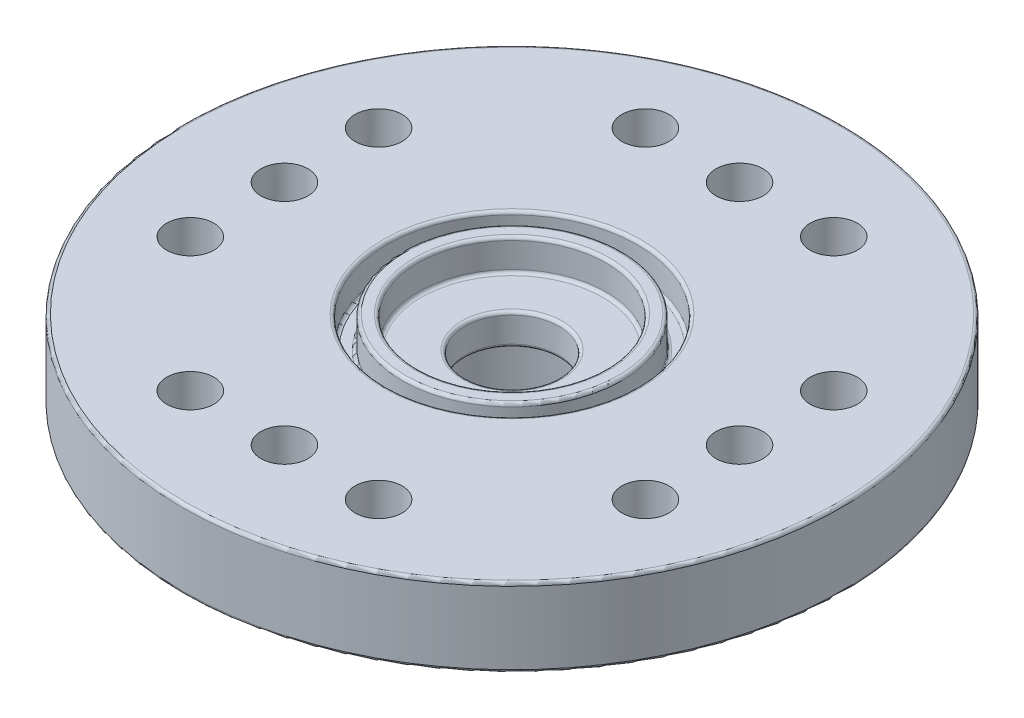
ISO-10303-21;
HEADER;
FILE_DESCRIPTION(('STEP AP214'),'2;1');
FILE_NAME('part.step','',(''),(''),'','','');
FILE_SCHEMA(('AUTOMOTIVE_DESIGN { 1 0 10303 214 1 1 1 1 }'));
ENDSEC;
DATA;
#1=APPLICATION_CONTEXT('core data for automotive mechanical design processes');
#2=APPLICATION_PROTOCOL_DEFINITION('international standard','automotive_design',2000,#1);
#3=PRODUCT_CONTEXT('',#1,'mechanical');
#4=PRODUCT('Part','Part','',(#3));
#5=PRODUCT_RELATED_PRODUCT_CATEGORY('part','',(#4));
#6=PRODUCT_DEFINITION_FORMATION('','',#4);
#7=PRODUCT_DEFINITION_CONTEXT('part definition',#1,'design');
#8=PRODUCT_DEFINITION('design','',#6,#7);
#9=PRODUCT_DEFINITION_SHAPE('','',#8);
#10=(LENGTH_UNIT() NAMED_UNIT(*) SI_UNIT(.MILLI.,.METRE.));
#11=(NAMED_UNIT(*) PLANE_ANGLE_UNIT() SI_UNIT($,.RADIAN.));
#12=(NAMED_UNIT(*) SI_UNIT($,.STERADIAN.) SOLID_ANGLE_UNIT());
#13=UNCERTAINTY_MEASURE_WITH_UNIT(LENGTH_MEASURE(1.E-05),#10,'distance_accuracy_value','');
#14=(GEOMETRIC_REPRESENTATION_CONTEXT(3) GLOBAL_UNCERTAINTY_ASSIGNED_CONTEXT((#13)) GLOBAL_UNIT_ASSIGNED_CONTEXT((#10,
#11,#12)) REPRESENTATION_CONTEXT('',''));
#15=CARTESIAN_POINT('',(0.,0.,0.));
#16=DIRECTION('',(0.,0.,1.));
#17=DIRECTION('',(1.,0.,0.));
#18=AXIS2_PLACEMENT_3D('',#15,#16,#17);
#19=CARTESIAN_POINT('',(0.,2.5,0.));
#20=DIRECTION('',(0.,1.,0.));
#21=DIRECTION('',(0.,0.,1.));
#22=AXIS2_PLACEMENT_3D('',#19,#20,#21);
#23=PLANE('',#22);
#24=CARTESIAN_POINT('',(0.,2.5,0.));
#25=DIRECTION('',(0.,1.,0.));
#26=DIRECTION('',(0.,0.,1.));
#27=AXIS2_PLACEMENT_3D('',#24,#25,#26);
#28=CIRCLE('',#27,3.1);
#29=CARTESIAN_POINT('',(0.,2.5,3.1));
#30=VERTEX_POINT('',#29);
#31=EDGE_CURVE('E57',#30,#30,#28,.F.);
#32=ORIENTED_EDGE('',*,*,#31,.T.);
#33=EDGE_LOOP('',(#32));
#34=FACE_BOUND('',#33,.T.);
#35=CARTESIAN_POINT('',(0.,2.5,0.));
#36=DIRECTION('',(0.,1.,0.));
#37=DIRECTION('',(0.,0.,1.));
#38=AXIS2_PLACEMENT_3D('',#35,#36,#37);
#39=CIRCLE('',#38,3.4);
#40=CARTESIAN_POINT('',(0.,2.5,3.4));
#41=VERTEX_POINT('',#40);
#42=EDGE_CURVE('E60',#41,#41,#39,.T.);
#43=ORIENTED_EDGE('',*,*,#42,.T.);
#44=EDGE_LOOP('',(#43));
#45=FACE_BOUND('',#44,.T.);
#46=ADVANCED_FACE('F34',(#34,#45),#23,.T.);
#47=CARTESIAN_POINT('',(0.,-9.5,0.));
#48=DIRECTION('',(0.,1.,0.));
#49=DIRECTION('',(0.,0.,1.));
#50=AXIS2_PLACEMENT_3D('',#47,#48,#49);
#51=CYLINDRICAL_SURFACE('',#50,3.);
#52=CARTESIAN_POINT('',(0.,-2.9,0.));
#53=DIRECTION('',(0.,-1.,0.));
#54=DIRECTION('',(0.,0.,-1.));
#55=AXIS2_PLACEMENT_3D('',#52,#53,#54);
#56=CIRCLE('',#55,3.);
#57=CARTESIAN_POINT('',(0.,-2.9,-3.));
#58=VERTEX_POINT('',#57);
#59=EDGE_CURVE('E111',#58,#58,#56,.T.);
#60=ORIENTED_EDGE('',*,*,#59,.T.);
#61=EDGE_LOOP('',(#60));
#62=FACE_BOUND('',#61,.T.);
#63=CARTESIAN_POINT('',(0.,0.5,0.));
#64=DIRECTION('',(0.,1.,0.));
#65=DIRECTION('',(0.,0.,1.));
#66=AXIS2_PLACEMENT_3D('',#63,#64,#65);
#67=CIRCLE('',#66,3.);
#68=CARTESIAN_POINT('',(0.,0.5,3.));
#69=VERTEX_POINT('',#68);
#70=EDGE_CURVE('E114',#69,#69,#67,.F.);
#71=ORIENTED_EDGE('',*,*,#70,.F.);
#72=EDGE_LOOP('',(#71));
#73=FACE_BOUND('',#72,.T.);
#74=ADVANCED_FACE('F215',(#62,#73),#51,.F.);
#75=CARTESIAN_POINT('',(0.,0.,0.));
#76=DIRECTION('',(0.,1.,0.));
#77=DIRECTION('',(0.,0.,1.));
#78=AXIS2_PLACEMENT_3D('',#75,#76,#77);
#79=PLANE('',#78);
#80=CARTESIAN_POINT('',(0.,0.,0.));
#81=DIRECTION('',(0.,1.,0.));
#82=DIRECTION('',(0.,0.,1.));
#83=AXIS2_PLACEMENT_3D('',#80,#81,#82);
#84=CIRCLE('',#83,10.4);
#85=CARTESIAN_POINT('',(0.,0.,10.4));
#86=VERTEX_POINT('',#85);
#87=EDGE_CURVE('E10',#86,#86,#84,.F.);
#88=ORIENTED_EDGE('',*,*,#87,.T.);
#89=EDGE_LOOP('',(#88));
#90=FACE_BOUND('',#89,.T.);
#91=CARTESIAN_POINT('',(-7.25,0.,-3.));
#92=DIRECTION('',(0.,1.,0.));
#93=DIRECTION('',(0.,0.,1.));
#94=AXIS2_PLACEMENT_3D('',#91,#92,#93);
#95=CIRCLE('',#94,0.749999999999999);
#96=CARTESIAN_POINT('',(-7.25,0.,-2.25));
#97=VERTEX_POINT('',#96);
#98=EDGE_CURVE('E120',#97,#97,#95,.T.);
#99=ORIENTED_EDGE('',*,*,#98,.T.);
#100=EDGE_LOOP('',(#99));
#101=FACE_BOUND('',#100,.T.);
#102=CARTESIAN_POINT('',(-7.25,0.,0.));
#103=DIRECTION('',(0.,1.,0.));
#104=DIRECTION('',(0.,0.,1.));
#105=AXIS2_PLACEMENT_3D('',#102,#103,#104);
#106=CIRCLE('',#105,0.749999999999999);
#107=CARTESIAN_POINT('',(-7.25,0.,0.749999999999999));
#108=VERTEX_POINT('',#107);
#109=EDGE_CURVE('E123',#108,#108,#106,.T.);
#110=ORIENTED_EDGE('',*,*,#109,.T.);
#111=EDGE_LOOP('',(#110));
#112=FACE_BOUND('',#111,.T.);
#113=CARTESIAN_POINT('',(-7.25,0.,3.));
#114=DIRECTION('',(0.,1.,0.));
#115=DIRECTION('',(0.,0.,1.));
#116=AXIS2_PLACEMENT_3D('',#113,#114,#115);
#117=CIRCLE('',#116,0.749999999999999);
#118=CARTESIAN_POINT('',(-7.25,0.,3.75));
#119=VERTEX_POINT('',#118);
#120=EDGE_CURVE('E126',#119,#119,#117,.T.);
#121=ORIENTED_EDGE('',*,*,#120,.T.);
#122=EDGE_LOOP('',(#121));
#123=FACE_BOUND('',#122,.T.);
#124=CARTESIAN_POINT('',(-3.,0.,7.25));
#125=DIRECTION('',(0.,1.,0.));
#126=DIRECTION('',(0.,0.,1.));
#127=AXIS2_PLACEMENT_3D('',#124,#125,#126);
#128=CIRCLE('',#127,0.75);
#129=CARTESIAN_POINT('',(-3.,0.,8.));
#130=VERTEX_POINT('',#129);
#131=EDGE_CURVE('E129',#130,#130,#128,.T.);
#132=ORIENTED_EDGE('',*,*,#131,.T.);
#133=EDGE_LOOP('',(#132));
#134=FACE_BOUND('',#133,.T.);
#135=CARTESIAN_POINT('',(0.,0.,7.25));
#136=DIRECTION('',(0.,1.,0.));
#137=DIRECTION('',(0.,0.,1.));
#138=AXIS2_PLACEMENT_3D('',#135,#136,#137);
#139=CIRCLE('',#138,0.75);
#140=CARTESIAN_POINT('',(0.,0.,8.));
#141=VERTEX_POINT('',#140);
#142=EDGE_CURVE('E132',#141,#141,#139,.T.);
#143=ORIENTED_EDGE('',*,*,#142,.T.);
#144=EDGE_LOOP('',(#143));
#145=FACE_BOUND('',#144,.T.);
#146=CARTESIAN_POINT('',(3.,0.,7.25));
#147=DIRECTION('',(0.,1.,0.));
#148=DIRECTION('',(0.,0.,1.));
#149=AXIS2_PLACEMENT_3D('',#146,#147,#148);
#150=CIRCLE('',#149,0.75);
#151=CARTESIAN_POINT('',(3.,0.,8.));
#152=VERTEX_POINT('',#151);
#153=EDGE_CURVE('E135',#152,#152,#150,.T.);
#154=ORIENTED_EDGE('',*,*,#153,.T.);
#155=EDGE_LOOP('',(#154));
#156=FACE_BOUND('',#155,.T.);
#157=CARTESIAN_POINT('',(7.25,0.,3.));
#158=DIRECTION('',(0.,1.,0.));
#159=DIRECTION('',(0.,0.,1.));
#160=AXIS2_PLACEMENT_3D('',#157,#158,#159);
#161=CIRCLE('',#160,0.749999999999999);
#162=CARTESIAN_POINT('',(7.25,0.,3.75));
#163=VERTEX_POINT('',#162);
#164=EDGE_CURVE('E138',#163,#163,#161,.T.);
#165=ORIENTED_EDGE('',*,*,#164,.T.);
#166=EDGE_LOOP('',(#165));
#167=FACE_BOUND('',#166,.T.);
#168=CARTESIAN_POINT('',(-3.,0.,-7.25));
#169=DIRECTION('',(0.,1.,0.));
#170=DIRECTION('',(0.,0.,1.));
#171=AXIS2_PLACEMENT_3D('',#168,#169,#170);
#172=CIRCLE('',#171,0.75);
#173=CARTESIAN_POINT('',(-3.,0.,-6.5));
#174=VERTEX_POINT('',#173);
#175=EDGE_CURVE('E141',#174,#174,#172,.T.);
#176=ORIENTED_EDGE('',*,*,#175,.T.);
#177=EDGE_LOOP('',(#176));
#178=FACE_BOUND('',#177,.T.);
#179=CARTESIAN_POINT('',(3.,0.,-7.25));
#180=DIRECTION('',(0.,1.,0.));
#181=DIRECTION('',(0.,0.,1.));
#182=AXIS2_PLACEMENT_3D('',#179,#180,#181);
#183=CIRCLE('',#182,0.75);
#184=CARTESIAN_POINT('',(3.,0.,-6.5));
#185=VERTEX_POINT('',#184);
#186=EDGE_CURVE('E144',#185,#185,#183,.T.);
#187=ORIENTED_EDGE('',*,*,#186,.T.);
#188=EDGE_LOOP('',(#187));
#189=FACE_BOUND('',#188,.T.);
#190=CARTESIAN_POINT('',(7.25,0.,-3.));
#191=DIRECTION('',(0.,1.,0.));
#192=DIRECTION('',(0.,0.,1.));
#193=AXIS2_PLACEMENT_3D('',#190,#191,#192);
#194=CIRCLE('',#193,0.749999999999999);
#195=CARTESIAN_POINT('',(7.25,0.,-2.25));
#196=VERTEX_POINT('',#195);
#197=EDGE_CURVE('E147',#196,#196,#194,.T.);
#198=ORIENTED_EDGE('',*,*,#197,.T.);
#199=EDGE_LOOP('',(#198));
#200=FACE_BOUND('',#199,.T.);
#201=CARTESIAN_POINT('',(7.25,0.,0.));
#202=DIRECTION('',(0.,1.,0.));
#203=DIRECTION('',(0.,0.,1.));
#204=AXIS2_PLACEMENT_3D('',#201,#202,#203);
#205=CIRCLE('',#204,0.749999999999999);
#206=CARTESIAN_POINT('',(7.25,0.,0.749999999999999));
#207=VERTEX_POINT('',#206);
#208=EDGE_CURVE('E150',#207,#207,#205,.T.);
#209=ORIENTED_EDGE('',*,*,#208,.T.);
#210=EDGE_LOOP('',(#209));
#211=FACE_BOUND('',#210,.T.);
#212=CARTESIAN_POINT('',(0.,0.,-7.25));
#213=DIRECTION('',(0.,1.,0.));
#214=DIRECTION('',(0.,0.,1.));
#215=AXIS2_PLACEMENT_3D('',#212,#213,#214);
#216=CIRCLE('',#215,0.75);
#217=CARTESIAN_POINT('',(0.,0.,-6.5));
#218=VERTEX_POINT('',#217);
#219=EDGE_CURVE('E153',#218,#218,#216,.T.);
#220=ORIENTED_EDGE('',*,*,#219,.T.);
#221=EDGE_LOOP('',(#220));
#222=FACE_BOUND('',#221,.T.);
#223=CARTESIAN_POINT('',(0.,0.,0.));
#224=DIRECTION('',(0.,1.,0.));
#225=DIRECTION('',(0.,0.,1.));
#226=AXIS2_PLACEMENT_3D('',#223,#224,#225);
#227=CIRCLE('',#226,4.);
#228=CARTESIAN_POINT('',(0.,0.,4.));
#229=VERTEX_POINT('',#228);
#230=EDGE_CURVE('E117',#229,#229,#227,.F.);
#231=ORIENTED_EDGE('',*,*,#230,.F.);
#232=EDGE_LOOP('',(#231));
#233=FACE_BOUND('',#232,.T.);
#234=ADVANCED_FACE('F212',(#90,#101,#112,#123,#134,#145,#156,#167,#178,#189,#200,#211,#222,
#233),#79,.F.);
#235=CARTESIAN_POINT('',(0.,2.5,0.));
#236=DIRECTION('',(0.,-1.,0.));
#237=DIRECTION('',(0.,0.,-1.));
#238=AXIS2_PLACEMENT_3D('',#235,#236,#237);
#239=CYLINDRICAL_SURFACE('',#238,10.5);
#240=CARTESIAN_POINT('',(0.,0.0999999999999998,0.));
#241=DIRECTION('',(0.,1.,0.));
#242=DIRECTION('',(0.,0.,1.));
#243=AXIS2_PLACEMENT_3D('',#240,#241,#242);
#244=CIRCLE('',#243,10.5);
#245=CARTESIAN_POINT('',(0.,0.0999999999999998,10.5));
#246=VERTEX_POINT('',#245);
#247=EDGE_CURVE('E41',#246,#246,#244,.T.);
#248=ORIENTED_EDGE('',*,*,#247,.T.);
#249=EDGE_LOOP('',(#248));
#250=FACE_BOUND('',#249,.T.);
#251=CARTESIAN_POINT('',(0.,2.4,0.));
#252=DIRECTION('',(0.,1.,0.));
#253=DIRECTION('',(0.,0.,1.));
#254=AXIS2_PLACEMENT_3D('',#251,#252,#253);
#255=CIRCLE('',#254,10.5);
#256=CARTESIAN_POINT('',(0.,2.4,10.5));
#257=VERTEX_POINT('',#256);
#258=EDGE_CURVE('E45',#257,#257,#255,.F.);
#259=ORIENTED_EDGE('',*,*,#258,.T.);
#260=EDGE_LOOP('',(#259));
#261=FACE_BOUND('',#260,.T.);
#262=ADVANCED_FACE('F200',(#250,#261),#239,.T.);
#263=CARTESIAN_POINT('',(0.,2.5,0.));
#264=DIRECTION('',(0.,1.,0.));
#265=DIRECTION('',(0.,0.,1.));
#266=AXIS2_PLACEMENT_3D('',#263,#264,#265);
#267=CIRCLE('',#266,4.1);
#268=CARTESIAN_POINT('',(0.,2.5,4.1));
#269=VERTEX_POINT('',#268);
#270=EDGE_CURVE('E49',#269,#269,#267,.F.);
#271=ORIENTED_EDGE('',*,*,#270,.T.);
#272=EDGE_LOOP('',(#271));
#273=FACE_BOUND('',#272,.T.);
#274=CARTESIAN_POINT('',(0.,2.5,0.));
#275=DIRECTION('',(0.,1.,0.));
#276=DIRECTION('',(0.,0.,1.));
#277=AXIS2_PLACEMENT_3D('',#274,#275,#276);
#278=CIRCLE('',#277,10.4);
#279=CARTESIAN_POINT('',(0.,2.5,10.4));
#280=VERTEX_POINT('',#279);
#281=EDGE_CURVE('E54',#280,#280,#278,.T.);
#282=ORIENTED_EDGE('',*,*,#281,.T.);
#283=EDGE_LOOP('',(#282));
#284=FACE_BOUND('',#283,.T.);
#285=CARTESIAN_POINT('',(-7.25,2.5,-3.));
#286=DIRECTION('',(0.,1.,0.));
#287=DIRECTION('',(0.,0.,-1.));
#288=AXIS2_PLACEMENT_3D('',#285,#286,#287);
#289=CIRCLE('',#288,0.749999999999999);
#290=CARTESIAN_POINT('',(-7.25,2.5,-3.75));
#291=VERTEX_POINT('',#290);
#292=EDGE_CURVE('E160',#291,#291,#289,.T.);
#293=ORIENTED_EDGE('',*,*,#292,.F.);
#294=EDGE_LOOP('',(#293));
#295=FACE_BOUND('',#294,.T.);
#296=CARTESIAN_POINT('',(-7.25,2.5,0.));
#297=DIRECTION('',(0.,1.,0.));
#298=DIRECTION('',(0.,0.,-1.));
#299=AXIS2_PLACEMENT_3D('',#296,#297,#298);
#300=CIRCLE('',#299,0.749999999999999);
#301=CARTESIAN_POINT('',(-7.25,2.5,-0.749999999999999));
#302=VERTEX_POINT('',#301);
#303=EDGE_CURVE('E163',#302,#302,#300,.T.);
#304=ORIENTED_EDGE('',*,*,#303,.F.);
#305=EDGE_LOOP('',(#304));
#306=FACE_BOUND('',#305,.T.);
#307=CARTESIAN_POINT('',(-7.25,2.5,3.));
#308=DIRECTION('',(0.,1.,0.));
#309=DIRECTION('',(0.,0.,1.));
#310=AXIS2_PLACEMENT_3D('',#307,#308,#309);
#311=CIRCLE('',#310,0.749999999999999);
#312=CARTESIAN_POINT('',(-7.25,2.5,3.75));
#313=VERTEX_POINT('',#312);
#314=EDGE_CURVE('E166',#313,#313,#311,.T.);
#315=ORIENTED_EDGE('',*,*,#314,.F.);
#316=EDGE_LOOP('',(#315));
#317=FACE_BOUND('',#316,.T.);
#318=CARTESIAN_POINT('',(-3.,2.5,7.25));
#319=DIRECTION('',(0.,1.,0.));
#320=DIRECTION('',(0.,0.,1.));
#321=AXIS2_PLACEMENT_3D('',#318,#319,#320);
#322=CIRCLE('',#321,0.75);
#323=CARTESIAN_POINT('',(-3.,2.5,8.));
#324=VERTEX_POINT('',#323);
#325=EDGE_CURVE('E169',#324,#324,#322,.T.);
#326=ORIENTED_EDGE('',*,*,#325,.F.);
#327=EDGE_LOOP('',(#326));
#328=FACE_BOUND('',#327,.T.);
#329=CARTESIAN_POINT('',(0.,2.5,7.25));
#330=DIRECTION('',(0.,1.,0.));
#331=DIRECTION('',(0.,0.,-1.));
#332=AXIS2_PLACEMENT_3D('',#329,#330,#331);
#333=CIRCLE('',#332,0.75);
#334=CARTESIAN_POINT('',(0.,2.5,6.5));
#335=VERTEX_POINT('',#334);
#336=EDGE_CURVE('E172',#335,#335,#333,.T.);
#337=ORIENTED_EDGE('',*,*,#336,.F.);
#338=EDGE_LOOP('',(#337));
#339=FACE_BOUND('',#338,.T.);
#340=CARTESIAN_POINT('',(3.,2.5,7.25));
#341=DIRECTION('',(0.,1.,0.));
#342=DIRECTION('',(0.,0.,-1.));
#343=AXIS2_PLACEMENT_3D('',#340,#341,#342);
#344=CIRCLE('',#343,0.75);
#345=CARTESIAN_POINT('',(3.,2.5,6.5));
#346=VERTEX_POINT('',#345);
#347=EDGE_CURVE('E175',#346,#346,#344,.T.);
#348=ORIENTED_EDGE('',*,*,#347,.F.);
#349=EDGE_LOOP('',(#348));
#350=FACE_BOUND('',#349,.T.);
#351=CARTESIAN_POINT('',(7.25,2.5,3.));
#352=DIRECTION('',(0.,1.,0.));
#353=DIRECTION('',(0.,0.,-1.));
#354=AXIS2_PLACEMENT_3D('',#351,#352,#353);
#355=CIRCLE('',#354,0.749999999999999);
#356=CARTESIAN_POINT('',(7.25,2.5,2.25));
#357=VERTEX_POINT('',#356);
#358=EDGE_CURVE('E178',#357,#357,#355,.T.);
#359=ORIENTED_EDGE('',*,*,#358,.F.);
#360=EDGE_LOOP('',(#359));
#361=FACE_BOUND('',#360,.T.);
#362=CARTESIAN_POINT('',(-3.,2.5,-7.25));
#363=DIRECTION('',(0.,1.,0.));
#364=DIRECTION('',(0.,0.,-1.));
#365=AXIS2_PLACEMENT_3D('',#362,#363,#364);
#366=CIRCLE('',#365,0.75);
#367=CARTESIAN_POINT('',(-3.,2.5,-8.));
#368=VERTEX_POINT('',#367);
#369=EDGE_CURVE('E181',#368,#368,#366,.T.);
#370=ORIENTED_EDGE('',*,*,#369,.F.);
#371=EDGE_LOOP('',(#370));
#372=FACE_BOUND('',#371,.T.);
#373=CARTESIAN_POINT('',(3.,2.5,-7.25));
#374=DIRECTION('',(0.,1.,0.));
#375=DIRECTION('',(0.,0.,1.));
#376=AXIS2_PLACEMENT_3D('',#373,#374,#375);
#377=CIRCLE('',#376,0.75);
#378=CARTESIAN_POINT('',(3.,2.5,-6.5));
#379=VERTEX_POINT('',#378);
#380=EDGE_CURVE('E184',#379,#379,#377,.T.);
#381=ORIENTED_EDGE('',*,*,#380,.F.);
#382=EDGE_LOOP('',(#381));
#383=FACE_BOUND('',#382,.T.);
#384=CARTESIAN_POINT('',(7.25,2.5,-3.));
#385=DIRECTION('',(0.,1.,0.));
#386=DIRECTION('',(0.,0.,1.));
#387=AXIS2_PLACEMENT_3D('',#384,#385,#386);
#388=CIRCLE('',#387,0.749999999999999);
#389=CARTESIAN_POINT('',(7.25,2.5,-2.25));
#390=VERTEX_POINT('',#389);
#391=EDGE_CURVE('E187',#390,#390,#388,.T.);
#392=ORIENTED_EDGE('',*,*,#391,.F.);
#393=EDGE_LOOP('',(#392));
#394=FACE_BOUND('',#393,.T.);
#395=CARTESIAN_POINT('',(7.25,2.5,0.));
#396=DIRECTION('',(0.,1.,0.));
#397=DIRECTION('',(0.,0.,1.));
#398=AXIS2_PLACEMENT_3D('',#395,#396,#397);
#399=CIRCLE('',#398,0.749999999999999);
#400=CARTESIAN_POINT('',(7.25,2.5,0.749999999999999));
#401=VERTEX_POINT('',#400);
#402=EDGE_CURVE('E159',#401,#401,#399,.T.);
#403=ORIENTED_EDGE('',*,*,#402,.F.);
#404=EDGE_LOOP('',(#403));
#405=FACE_BOUND('',#404,.T.);
#406=CARTESIAN_POINT('',(0.,2.5,-7.25));
#407=DIRECTION('',(0.,1.,0.));
#408=DIRECTION('',(0.,0.,1.));
#409=AXIS2_PLACEMENT_3D('',#406,#407,#408);
#410=CIRCLE('',#409,0.75);
#411=CARTESIAN_POINT('',(0.,2.5,-6.5));
#412=VERTEX_POINT('',#411);
#413=EDGE_CURVE('E156',#412,#412,#410,.T.);
#414=ORIENTED_EDGE('',*,*,#413,.F.);
#415=EDGE_LOOP('',(#414));
#416=FACE_BOUND('',#415,.T.);
#417=ADVANCED_FACE('F196',(#273,#284,#295,#306,#317,#328,#339,#350,#361,#372,#383,#394,#405,
#416),#23,.T.);
#418=CARTESIAN_POINT('',(0.,-3.,0.));
#419=DIRECTION('',(0.,-1.,0.));
#420=DIRECTION('',(0.,0.,-1.));
#421=AXIS2_PLACEMENT_3D('',#418,#419,#420);
#422=PLANE('',#421);
#423=CARTESIAN_POINT('',(0.,-3.,0.));
#424=DIRECTION('',(0.,-1.,0.));
#425=DIRECTION('',(0.,0.,-1.));
#426=AXIS2_PLACEMENT_3D('',#423,#424,#425);
#427=CIRCLE('',#426,3.1);
#428=CARTESIAN_POINT('',(0.,-3.,-3.1));
#429=VERTEX_POINT('',#428);
#430=EDGE_CURVE('E105',#429,#429,#427,.F.);
#431=ORIENTED_EDGE('',*,*,#430,.T.);
#432=EDGE_LOOP('',(#431));
#433=FACE_BOUND('',#432,.T.);
#434=CARTESIAN_POINT('',(0.,-3.,0.));
#435=DIRECTION('',(0.,-1.,0.));
#436=DIRECTION('',(0.,0.,-1.));
#437=AXIS2_PLACEMENT_3D('',#434,#435,#436);
#438=CIRCLE('',#437,3.9);
#439=CARTESIAN_POINT('',(0.,-3.,-3.9));
#440=VERTEX_POINT('',#439);
#441=EDGE_CURVE('E108',#440,#440,#438,.T.);
#442=ORIENTED_EDGE('',*,*,#441,.T.);
#443=EDGE_LOOP('',(#442));
#444=FACE_BOUND('',#443,.T.);
#445=ADVANCED_FACE('F199',(#433,#444),#422,.T.);
#446=CARTESIAN_POINT('',(0.,-3.,0.));
#447=DIRECTION('',(0.,1.,0.));
#448=DIRECTION('',(0.,0.,1.));
#449=AXIS2_PLACEMENT_3D('',#446,#447,#448);
#450=CYLINDRICAL_SURFACE('',#449,4.);
#451=CARTESIAN_POINT('',(0.,-2.9,0.));
#452=DIRECTION('',(0.,-1.,0.));
#453=DIRECTION('',(0.,0.,-1.));
#454=AXIS2_PLACEMENT_3D('',#451,#452,#453);
#455=CIRCLE('',#454,4.);
#456=CARTESIAN_POINT('',(0.,-2.9,-4.));
#457=VERTEX_POINT('',#456);
#458=EDGE_CURVE('E102',#457,#457,#455,.F.);
#459=ORIENTED_EDGE('',*,*,#458,.T.);
#460=EDGE_LOOP('',(#459));
#461=FACE_BOUND('',#460,.T.);
#462=ORIENTED_EDGE('',*,*,#230,.T.);
#463=EDGE_LOOP('',(#462));
#464=FACE_BOUND('',#463,.T.);
#465=ADVANCED_FACE('F208',(#461,#464),#450,.T.);
#466=CARTESIAN_POINT('',(0.,-0.5,-7.25));
#467=DIRECTION('',(0.,1.,0.));
#468=DIRECTION('',(0.,0.,1.));
#469=AXIS2_PLACEMENT_3D('',#466,#467,#468);
#470=CYLINDRICAL_SURFACE('',#469,0.75);
#471=ORIENTED_EDGE('',*,*,#413,.T.);
#472=EDGE_LOOP('',(#471));
#473=FACE_BOUND('',#472,.T.);
#474=ORIENTED_EDGE('',*,*,#219,.F.);
#475=EDGE_LOOP('',(#474));
#476=FACE_BOUND('',#475,.T.);
#477=ADVANCED_FACE('F205',(#473,#476),#470,.F.);
#478=CARTESIAN_POINT('',(7.25,-0.5,0.));
#479=DIRECTION('',(0.,1.,0.));
#480=DIRECTION('',(0.,0.,1.));
#481=AXIS2_PLACEMENT_3D('',#478,#479,#480);
#482=CYLINDRICAL_SURFACE('',#481,0.749999999999999);
#483=ORIENTED_EDGE('',*,*,#402,.T.);
#484=EDGE_LOOP('',(#483));
#485=FACE_BOUND('',#484,.T.);
#486=ORIENTED_EDGE('',*,*,#208,.F.);
#487=EDGE_LOOP('',(#486));
#488=FACE_BOUND('',#487,.T.);
#489=ADVANCED_FACE('F193',(#485,#488),#482,.F.);
#490=CARTESIAN_POINT('',(7.25,-0.5,-3.));
#491=DIRECTION('',(0.,1.,0.));
#492=DIRECTION('',(0.,0.,1.));
#493=AXIS2_PLACEMENT_3D('',#490,#491,#492);
#494=CYLINDRICAL_SURFACE('',#493,0.749999999999999);
#495=ORIENTED_EDGE('',*,*,#391,.T.);
#496=EDGE_LOOP('',(#495));
#497=FACE_BOUND('',#496,.T.);
#498=ORIENTED_EDGE('',*,*,#197,.F.);
#499=EDGE_LOOP('',(#498));
#500=FACE_BOUND('',#499,.T.);
#501=ADVANCED_FACE('F313',(#497,#500),#494,.F.);
#502=CARTESIAN_POINT('',(3.,-0.5,-7.25));
#503=DIRECTION('',(0.,1.,0.));
#504=DIRECTION('',(0.,0.,1.));
#505=AXIS2_PLACEMENT_3D('',#502,#503,#504);
#506=CYLINDRICAL_SURFACE('',#505,0.75);
#507=ORIENTED_EDGE('',*,*,#380,.T.);
#508=EDGE_LOOP('',(#507));
#509=FACE_BOUND('',#508,.T.);
#510=ORIENTED_EDGE('',*,*,#186,.F.);
#511=EDGE_LOOP('',(#510));
#512=FACE_BOUND('',#511,.T.);
#513=ADVANCED_FACE('F316',(#509,#512),#506,.F.);
#514=CARTESIAN_POINT('',(-3.,-0.5,-7.25));
#515=DIRECTION('',(0.,1.,0.));
#516=DIRECTION('',(0.,0.,1.));
#517=AXIS2_PLACEMENT_3D('',#514,#515,#516);
#518=CYLINDRICAL_SURFACE('',#517,0.75);
#519=ORIENTED_EDGE('',*,*,#369,.T.);
#520=EDGE_LOOP('',(#519));
#521=FACE_BOUND('',#520,.T.);
#522=ORIENTED_EDGE('',*,*,#175,.F.);
#523=EDGE_LOOP('',(#522));
#524=FACE_BOUND('',#523,.T.);
#525=ADVANCED_FACE('F332',(#521,#524),#518,.F.);
#526=CARTESIAN_POINT('',(7.25,-0.5,3.));
#527=DIRECTION('',(0.,1.,0.));
#528=DIRECTION('',(0.,0.,1.));
#529=AXIS2_PLACEMENT_3D('',#526,#527,#528);
#530=CYLINDRICAL_SURFACE('',#529,0.749999999999999);
#531=ORIENTED_EDGE('',*,*,#358,.T.);
#532=EDGE_LOOP('',(#531));
#533=FACE_BOUND('',#532,.T.);
#534=ORIENTED_EDGE('',*,*,#164,.F.);
#535=EDGE_LOOP('',(#534));
#536=FACE_BOUND('',#535,.T.);
#537=ADVANCED_FACE('F336',(#533,#536),#530,.F.);
#538=CARTESIAN_POINT('',(3.,-0.5,7.25));
#539=DIRECTION('',(0.,1.,0.));
#540=DIRECTION('',(0.,0.,1.));
#541=AXIS2_PLACEMENT_3D('',#538,#539,#540);
#542=CYLINDRICAL_SURFACE('',#541,0.75);
#543=ORIENTED_EDGE('',*,*,#347,.T.);
#544=EDGE_LOOP('',(#543));
#545=FACE_BOUND('',#544,.T.);
#546=ORIENTED_EDGE('',*,*,#153,.F.);
#547=EDGE_LOOP('',(#546));
#548=FACE_BOUND('',#547,.T.);
#549=ADVANCED_FACE('F340',(#545,#548),#542,.F.);
#550=CARTESIAN_POINT('',(0.,-0.5,7.25));
#551=DIRECTION('',(0.,1.,0.));
#552=DIRECTION('',(0.,0.,1.));
#553=AXIS2_PLACEMENT_3D('',#550,#551,#552);
#554=CYLINDRICAL_SURFACE('',#553,0.75);
#555=ORIENTED_EDGE('',*,*,#336,.T.);
#556=EDGE_LOOP('',(#555));
#557=FACE_BOUND('',#556,.T.);
#558=ORIENTED_EDGE('',*,*,#142,.F.);
#559=EDGE_LOOP('',(#558));
#560=FACE_BOUND('',#559,.T.);
#561=ADVANCED_FACE('F344',(#557,#560),#554,.F.);
#562=CARTESIAN_POINT('',(-3.,-0.5,7.25));
#563=DIRECTION('',(0.,1.,0.));
#564=DIRECTION('',(0.,0.,1.));
#565=AXIS2_PLACEMENT_3D('',#562,#563,#564);
#566=CYLINDRICAL_SURFACE('',#565,0.75);
#567=ORIENTED_EDGE('',*,*,#325,.T.);
#568=EDGE_LOOP('',(#567));
#569=FACE_BOUND('',#568,.T.);
#570=ORIENTED_EDGE('',*,*,#131,.F.);
#571=EDGE_LOOP('',(#570));
#572=FACE_BOUND('',#571,.T.);
#573=ADVANCED_FACE('F348',(#569,#572),#566,.F.);
#574=CARTESIAN_POINT('',(-7.25,-0.5,3.));
#575=DIRECTION('',(0.,1.,0.));
#576=DIRECTION('',(0.,0.,1.));
#577=AXIS2_PLACEMENT_3D('',#574,#575,#576);
#578=CYLINDRICAL_SURFACE('',#577,0.749999999999999);
#579=ORIENTED_EDGE('',*,*,#314,.T.);
#580=EDGE_LOOP('',(#579));
#581=FACE_BOUND('',#580,.T.);
#582=ORIENTED_EDGE('',*,*,#120,.F.);
#583=EDGE_LOOP('',(#582));
#584=FACE_BOUND('',#583,.T.);
#585=ADVANCED_FACE('F352',(#581,#584),#578,.F.);
#586=CARTESIAN_POINT('',(-7.25,-0.5,0.));
#587=DIRECTION('',(0.,1.,0.));
#588=DIRECTION('',(0.,0.,1.));
#589=AXIS2_PLACEMENT_3D('',#586,#587,#588);
#590=CYLINDRICAL_SURFACE('',#589,0.749999999999999);
#591=ORIENTED_EDGE('',*,*,#303,.T.);
#592=EDGE_LOOP('',(#591));
#593=FACE_BOUND('',#592,.T.);
#594=ORIENTED_EDGE('',*,*,#109,.F.);
#595=EDGE_LOOP('',(#594));
#596=FACE_BOUND('',#595,.T.);
#597=ADVANCED_FACE('F356',(#593,#596),#590,.F.);
#598=CARTESIAN_POINT('',(-7.25,-0.5,-3.));
#599=DIRECTION('',(0.,1.,0.));
#600=DIRECTION('',(0.,0.,1.));
#601=AXIS2_PLACEMENT_3D('',#598,#599,#600);
#602=CYLINDRICAL_SURFACE('',#601,0.749999999999999);
#603=ORIENTED_EDGE('',*,*,#292,.T.);
#604=EDGE_LOOP('',(#603));
#605=FACE_BOUND('',#604,.T.);
#606=ORIENTED_EDGE('',*,*,#98,.F.);
#607=EDGE_LOOP('',(#606));
#608=FACE_BOUND('',#607,.T.);
#609=ADVANCED_FACE('F360',(#605,#608),#602,.F.);
#610=CARTESIAN_POINT('',(0.,0.5,0.));
#611=DIRECTION('',(0.,1.,0.));
#612=DIRECTION('',(0.,0.,1.));
#613=AXIS2_PLACEMENT_3D('',#610,#611,#612);
#614=PLANE('',#613);
#615=CARTESIAN_POINT('',(0.,0.5,0.));
#616=DIRECTION('',(0.,1.,0.));
#617=DIRECTION('',(0.,0.,1.));
#618=AXIS2_PLACEMENT_3D('',#615,#616,#617);
#619=CIRCLE('',#618,1.6);
#620=CARTESIAN_POINT('',(0.,0.5,1.6));
#621=VERTEX_POINT('',#620);
#622=EDGE_CURVE('E99',#621,#621,#619,.T.);
#623=ORIENTED_EDGE('',*,*,#622,.T.);
#624=EDGE_LOOP('',(#623));
#625=FACE_BOUND('',#624,.T.);
#626=ORIENTED_EDGE('',*,*,#70,.T.);
#627=EDGE_LOOP('',(#626));
#628=FACE_BOUND('',#627,.T.);
#629=ADVANCED_FACE('F327',(#625,#628),#614,.F.);
#630=CARTESIAN_POINT('',(0.,1.5,0.));
#631=DIRECTION('',(0.,1.,0.));
#632=DIRECTION('',(0.,0.,1.));
#633=AXIS2_PLACEMENT_3D('',#630,#631,#632);
#634=CYLINDRICAL_SURFACE('',#633,3.);
#635=CARTESIAN_POINT('',(0.,1.6,0.));
#636=DIRECTION('',(0.,1.,0.));
#637=DIRECTION('',(0.,0.,1.));
#638=AXIS2_PLACEMENT_3D('',#635,#636,#637);
#639=CIRCLE('',#638,3.);
#640=CARTESIAN_POINT('',(0.,1.6,3.));
#641=VERTEX_POINT('',#640);
#642=EDGE_CURVE('E81',#641,#641,#639,.F.);
#643=ORIENTED_EDGE('',*,*,#642,.T.);
#644=EDGE_LOOP('',(#643));
#645=FACE_BOUND('',#644,.T.);
#646=CARTESIAN_POINT('',(0.,2.4,0.));
#647=DIRECTION('',(0.,1.,0.));
#648=DIRECTION('',(0.,0.,1.));
#649=AXIS2_PLACEMENT_3D('',#646,#647,#648);
#650=CIRCLE('',#649,3.);
#651=CARTESIAN_POINT('',(0.,2.4,3.));
#652=VERTEX_POINT('',#651);
#653=EDGE_CURVE('E84',#652,#652,#650,.T.);
#654=ORIENTED_EDGE('',*,*,#653,.T.);
#655=EDGE_LOOP('',(#654));
#656=FACE_BOUND('',#655,.T.);
#657=ADVANCED_FACE('F367',(#645,#656),#634,.F.);
#658=CARTESIAN_POINT('',(0.,1.5,0.));
#659=DIRECTION('',(0.,1.,0.));
#660=DIRECTION('',(0.,0.,1.));
#661=AXIS2_PLACEMENT_3D('',#658,#659,#660);
#662=PLANE('',#661);
#663=CARTESIAN_POINT('',(0.,1.5,0.));
#664=DIRECTION('',(0.,1.,0.));
#665=DIRECTION('',(0.,0.,1.));
#666=AXIS2_PLACEMENT_3D('',#663,#664,#665);
#667=CIRCLE('',#666,1.6);
#668=CARTESIAN_POINT('',(0.,1.5,1.6));
#669=VERTEX_POINT('',#668);
#670=EDGE_CURVE('E87',#669,#669,#667,.F.);
#671=ORIENTED_EDGE('',*,*,#670,.T.);
#672=EDGE_LOOP('',(#671));
#673=FACE_BOUND('',#672,.T.);
#674=CARTESIAN_POINT('',(0.,1.5,0.));
#675=DIRECTION('',(0.,1.,0.));
#676=DIRECTION('',(0.,0.,1.));
#677=AXIS2_PLACEMENT_3D('',#674,#675,#676);
#678=CIRCLE('',#677,2.9);
#679=CARTESIAN_POINT('',(0.,1.5,2.9));
#680=VERTEX_POINT('',#679);
#681=EDGE_CURVE('E90',#680,#680,#678,.T.);
#682=ORIENTED_EDGE('',*,*,#681,.T.);
#683=EDGE_LOOP('',(#682));
#684=FACE_BOUND('',#683,.T.);
#685=ADVANCED_FACE('F399',(#673,#684),#662,.T.);
#686=CARTESIAN_POINT('',(0.,0.5,0.));
#687=DIRECTION('',(0.,1.,0.));
#688=DIRECTION('',(0.,0.,1.));
#689=AXIS2_PLACEMENT_3D('',#686,#687,#688);
#690=CYLINDRICAL_SURFACE('',#689,1.5);
#691=CARTESIAN_POINT('',(0.,0.6,0.));
#692=DIRECTION('',(0.,1.,0.));
#693=DIRECTION('',(0.,0.,1.));
#694=AXIS2_PLACEMENT_3D('',#691,#692,#693);
#695=CIRCLE('',#694,1.5);
#696=CARTESIAN_POINT('',(0.,0.6,1.5));
#697=VERTEX_POINT('',#696);
#698=EDGE_CURVE('E93',#697,#697,#695,.F.);
#699=ORIENTED_EDGE('',*,*,#698,.T.);
#700=EDGE_LOOP('',(#699));
#701=FACE_BOUND('',#700,.T.);
#702=CARTESIAN_POINT('',(0.,1.4,0.));
#703=DIRECTION('',(0.,1.,0.));
#704=DIRECTION('',(0.,0.,1.));
#705=AXIS2_PLACEMENT_3D('',#702,#703,#704);
#706=CIRCLE('',#705,1.5);
#707=CARTESIAN_POINT('',(0.,1.4,1.5));
#708=VERTEX_POINT('',#707);
#709=EDGE_CURVE('E96',#708,#708,#706,.T.);
#710=ORIENTED_EDGE('',*,*,#709,.T.);
#711=EDGE_LOOP('',(#710));
#712=FACE_BOUND('',#711,.T.);
#713=ADVANCED_FACE('F409',(#701,#712),#690,.F.);
#714=CARTESIAN_POINT('',(0.,1.5,0.));
#715=DIRECTION('',(0.,1.,0.));
#716=DIRECTION('',(0.,0.,1.));
#717=AXIS2_PLACEMENT_3D('',#714,#715,#716);
#718=CYLINDRICAL_SURFACE('',#717,4.);
#719=CARTESIAN_POINT('',(0.,1.6,0.));
#720=DIRECTION('',(0.,1.,0.));
#721=DIRECTION('',(0.,0.,1.));
#722=AXIS2_PLACEMENT_3D('',#719,#720,#721);
#723=CIRCLE('',#722,4.);
#724=CARTESIAN_POINT('',(0.,1.6,4.));
#725=VERTEX_POINT('',#724);
#726=EDGE_CURVE('E63',#725,#725,#723,.F.);
#727=ORIENTED_EDGE('',*,*,#726,.T.);
#728=EDGE_LOOP('',(#727));
#729=FACE_BOUND('',#728,.T.);
#730=CARTESIAN_POINT('',(0.,2.4,0.));
#731=DIRECTION('',(0.,1.,0.));
#732=DIRECTION('',(0.,0.,1.));
#733=AXIS2_PLACEMENT_3D('',#730,#731,#732);
#734=CIRCLE('',#733,4.);
#735=CARTESIAN_POINT('',(0.,2.4,4.));
#736=VERTEX_POINT('',#735);
#737=EDGE_CURVE('E66',#736,#736,#734,.T.);
#738=ORIENTED_EDGE('',*,*,#737,.T.);
#739=EDGE_LOOP('',(#738));
#740=FACE_BOUND('',#739,.T.);
#741=ADVANCED_FACE('F416',(#729,#740),#718,.F.);
#742=CARTESIAN_POINT('',(0.,1.5,0.));
#743=DIRECTION('',(0.,1.,0.));
#744=DIRECTION('',(0.,0.,1.));
#745=AXIS2_PLACEMENT_3D('',#742,#743,#744);
#746=PLANE('',#745);
#747=CARTESIAN_POINT('',(0.,1.5,0.));
#748=DIRECTION('',(0.,1.,0.));
#749=DIRECTION('',(0.,0.,1.));
#750=AXIS2_PLACEMENT_3D('',#747,#748,#749);
#751=CIRCLE('',#750,3.6);
#752=CARTESIAN_POINT('',(0.,1.5,3.6));
#753=VERTEX_POINT('',#752);
#754=EDGE_CURVE('E69',#753,#753,#751,.F.);
#755=ORIENTED_EDGE('',*,*,#754,.T.);
#756=EDGE_LOOP('',(#755));
#757=FACE_BOUND('',#756,.T.);
#758=CARTESIAN_POINT('',(0.,1.5,0.));
#759=DIRECTION('',(0.,1.,0.));
#760=DIRECTION('',(0.,0.,1.));
#761=AXIS2_PLACEMENT_3D('',#758,#759,#760);
#762=CIRCLE('',#761,3.9);
#763=CARTESIAN_POINT('',(0.,1.5,3.9));
#764=VERTEX_POINT('',#763);
#765=EDGE_CURVE('E72',#764,#764,#762,.T.);
#766=ORIENTED_EDGE('',*,*,#765,.T.);
#767=EDGE_LOOP('',(#766));
#768=FACE_BOUND('',#767,.T.);
#769=ADVANCED_FACE('F420',(#757,#768),#746,.T.);
#770=CARTESIAN_POINT('',(0.,1.5,0.));
#771=DIRECTION('',(0.,1.,0.));
#772=DIRECTION('',(0.,0.,1.));
#773=AXIS2_PLACEMENT_3D('',#770,#771,#772);
#774=CYLINDRICAL_SURFACE('',#773,3.5);
#775=CARTESIAN_POINT('',(0.,1.6,0.));
#776=DIRECTION('',(0.,1.,0.));
#777=DIRECTION('',(0.,0.,1.));
#778=AXIS2_PLACEMENT_3D('',#775,#776,#777);
#779=CIRCLE('',#778,3.5);
#780=CARTESIAN_POINT('',(0.,1.6,3.5));
#781=VERTEX_POINT('',#780);
#782=EDGE_CURVE('E75',#781,#781,#779,.T.);
#783=ORIENTED_EDGE('',*,*,#782,.T.);
#784=EDGE_LOOP('',(#783));
#785=FACE_BOUND('',#784,.T.);
#786=CARTESIAN_POINT('',(0.,2.4,0.));
#787=DIRECTION('',(0.,1.,0.));
#788=DIRECTION('',(0.,0.,1.));
#789=AXIS2_PLACEMENT_3D('',#786,#787,#788);
#790=CIRCLE('',#789,3.5);
#791=CARTESIAN_POINT('',(0.,2.4,3.5));
#792=VERTEX_POINT('',#791);
#793=EDGE_CURVE('E78',#792,#792,#790,.F.);
#794=ORIENTED_EDGE('',*,*,#793,.T.);
#795=EDGE_LOOP('',(#794));
#796=FACE_BOUND('',#795,.T.);
#797=ADVANCED_FACE('F242',(#785,#796),#774,.T.);
#798=CARTESIAN_POINT('',(0.,-2.9,0.));
#799=DIRECTION('',(0.,-1.,0.));
#800=DIRECTION('',(0.,0.,-1.));
#801=AXIS2_PLACEMENT_3D('',#798,#799,#800);
#802=TOROIDAL_SURFACE('',#801,3.1,0.1);
#803=ORIENTED_EDGE('',*,*,#430,.F.);
#804=EDGE_LOOP('',(#803));
#805=FACE_BOUND('',#804,.T.);
#806=ORIENTED_EDGE('',*,*,#59,.F.);
#807=EDGE_LOOP('',(#806));
#808=FACE_BOUND('',#807,.T.);
#809=ADVANCED_FACE('F238',(#805,#808),#802,.T.);
#810=CARTESIAN_POINT('',(0.,-2.9,0.));
#811=DIRECTION('',(0.,-1.,0.));
#812=DIRECTION('',(0.,0.,-1.));
#813=AXIS2_PLACEMENT_3D('',#810,#811,#812);
#814=TOROIDAL_SURFACE('',#813,3.9,0.1);
#815=ORIENTED_EDGE('',*,*,#458,.F.);
#816=EDGE_LOOP('',(#815));
#817=FACE_BOUND('',#816,.T.);
#818=ORIENTED_EDGE('',*,*,#441,.F.);
#819=EDGE_LOOP('',(#818));
#820=FACE_BOUND('',#819,.T.);
#821=ADVANCED_FACE('F241',(#817,#820),#814,.T.);
#822=CARTESIAN_POINT('',(0.,0.6,0.));
#823=DIRECTION('',(0.,1.,0.));
#824=DIRECTION('',(0.,0.,1.));
#825=AXIS2_PLACEMENT_3D('',#822,#823,#824);
#826=TOROIDAL_SURFACE('',#825,1.6,0.1);
#827=ORIENTED_EDGE('',*,*,#698,.F.);
#828=EDGE_LOOP('',(#827));
#829=FACE_BOUND('',#828,.T.);
#830=ORIENTED_EDGE('',*,*,#622,.F.);
#831=EDGE_LOOP('',(#830));
#832=FACE_BOUND('',#831,.T.);
#833=ADVANCED_FACE('F246',(#829,#832),#826,.T.);
#834=CARTESIAN_POINT('',(0.,1.4,0.));
#835=DIRECTION('',(0.,1.,0.));
#836=DIRECTION('',(0.,0.,1.));
#837=AXIS2_PLACEMENT_3D('',#834,#835,#836);
#838=TOROIDAL_SURFACE('',#837,1.6,0.1);
#839=ORIENTED_EDGE('',*,*,#670,.F.);
#840=EDGE_LOOP('',(#839));
#841=FACE_BOUND('',#840,.T.);
#842=ORIENTED_EDGE('',*,*,#709,.F.);
#843=EDGE_LOOP('',(#842));
#844=FACE_BOUND('',#843,.T.);
#845=ADVANCED_FACE('F250',(#841,#844),#838,.T.);
#846=CARTESIAN_POINT('',(0.,1.6,0.));
#847=DIRECTION('',(0.,1.,0.));
#848=DIRECTION('',(0.,0.,1.));
#849=AXIS2_PLACEMENT_3D('',#846,#847,#848);
#850=TOROIDAL_SURFACE('',#849,2.9,0.1);
#851=ORIENTED_EDGE('',*,*,#642,.F.);
#852=EDGE_LOOP('',(#851));
#853=FACE_BOUND('',#852,.T.);
#854=ORIENTED_EDGE('',*,*,#681,.F.);
#855=EDGE_LOOP('',(#854));
#856=FACE_BOUND('',#855,.T.);
#857=ADVANCED_FACE('F254',(#853,#856),#850,.F.);
#858=CARTESIAN_POINT('',(0.,1.6,0.));
#859=DIRECTION('',(0.,1.,0.));
#860=DIRECTION('',(0.,0.,1.));
#861=AXIS2_PLACEMENT_3D('',#858,#859,#860);
#862=TOROIDAL_SURFACE('',#861,3.6,0.1);
#863=ORIENTED_EDGE('',*,*,#754,.F.);
#864=EDGE_LOOP('',(#863));
#865=FACE_BOUND('',#864,.T.);
#866=ORIENTED_EDGE('',*,*,#782,.F.);
#867=EDGE_LOOP('',(#866));
#868=FACE_BOUND('',#867,.T.);
#869=ADVANCED_FACE('F258',(#865,#868),#862,.F.);
#870=CARTESIAN_POINT('',(0.,1.6,0.));
#871=DIRECTION('',(0.,1.,0.));
#872=DIRECTION('',(0.,0.,1.));
#873=AXIS2_PLACEMENT_3D('',#870,#871,#872);
#874=TOROIDAL_SURFACE('',#873,3.9,0.1);
#875=ORIENTED_EDGE('',*,*,#726,.F.);
#876=EDGE_LOOP('',(#875));
#877=FACE_BOUND('',#876,.T.);
#878=ORIENTED_EDGE('',*,*,#765,.F.);
#879=EDGE_LOOP('',(#878));
#880=FACE_BOUND('',#879,.T.);
#881=ADVANCED_FACE('F262',(#877,#880),#874,.F.);
#882=CARTESIAN_POINT('',(0.,2.4,0.));
#883=DIRECTION('',(0.,1.,0.));
#884=DIRECTION('',(0.,0.,1.));
#885=AXIS2_PLACEMENT_3D('',#882,#883,#884);
#886=TOROIDAL_SURFACE('',#885,3.1,0.1);
#887=ORIENTED_EDGE('',*,*,#31,.F.);
#888=EDGE_LOOP('',(#887));
#889=FACE_BOUND('',#888,.T.);
#890=ORIENTED_EDGE('',*,*,#653,.F.);
#891=EDGE_LOOP('',(#890));
#892=FACE_BOUND('',#891,.T.);
#893=ADVANCED_FACE('F266',(#889,#892),#886,.T.);
#894=CARTESIAN_POINT('',(0.,2.4,0.));
#895=DIRECTION('',(0.,1.,0.));
#896=DIRECTION('',(0.,0.,1.));
#897=AXIS2_PLACEMENT_3D('',#894,#895,#896);
#898=TOROIDAL_SURFACE('',#897,3.4,0.1);
#899=ORIENTED_EDGE('',*,*,#793,.F.);
#900=EDGE_LOOP('',(#899));
#901=FACE_BOUND('',#900,.T.);
#902=ORIENTED_EDGE('',*,*,#42,.F.);
#903=EDGE_LOOP('',(#902));
#904=FACE_BOUND('',#903,.T.);
#905=ADVANCED_FACE('F270',(#901,#904),#898,.T.);
#906=CARTESIAN_POINT('',(0.,2.4,0.));
#907=DIRECTION('',(0.,1.,0.));
#908=DIRECTION('',(0.,0.,1.));
#909=AXIS2_PLACEMENT_3D('',#906,#907,#908);
#910=TOROIDAL_SURFACE('',#909,4.1,0.1);
#911=ORIENTED_EDGE('',*,*,#270,.F.);
#912=EDGE_LOOP('',(#911));
#913=FACE_BOUND('',#912,.T.);
#914=ORIENTED_EDGE('',*,*,#737,.F.);
#915=EDGE_LOOP('',(#914));
#916=FACE_BOUND('',#915,.T.);
#917=ADVANCED_FACE('F274',(#913,#916),#910,.T.);
#918=CARTESIAN_POINT('',(0.,0.0999999999999998,0.));
#919=DIRECTION('',(0.,1.,0.));
#920=DIRECTION('',(0.,0.,1.));
#921=AXIS2_PLACEMENT_3D('',#918,#919,#920);
#922=TOROIDAL_SURFACE('',#921,10.4,0.1);
#923=ORIENTED_EDGE('',*,*,#87,.F.);
#924=EDGE_LOOP('',(#923));
#925=FACE_BOUND('',#924,.T.);
#926=ORIENTED_EDGE('',*,*,#247,.F.);
#927=EDGE_LOOP('',(#926));
#928=FACE_BOUND('',#927,.T.);
#929=ADVANCED_FACE('F277',(#925,#928),#922,.T.);
#930=CARTESIAN_POINT('',(0.,2.4,0.));
#931=DIRECTION('',(0.,1.,0.));
#932=DIRECTION('',(0.,0.,1.));
#933=AXIS2_PLACEMENT_3D('',#930,#931,#932);
#934=TOROIDAL_SURFACE('',#933,10.4,0.1);
#935=ORIENTED_EDGE('',*,*,#258,.F.);
#936=EDGE_LOOP('',(#935));
#937=FACE_BOUND('',#936,.T.);
#938=ORIENTED_EDGE('',*,*,#281,.F.);
#939=EDGE_LOOP('',(#938));
#940=FACE_BOUND('',#939,.T.);
#941=ADVANCED_FACE('F36',(#937,#940),#934,.T.);
#942=CLOSED_SHELL('',(#46,#74,#234,#262,#417,#445,#465,#477,#489,#501,#513,#525,#537,#549,#561,
#573,#585,#597,#609,#629,#657,#685,#713,#741,#769,#797,#809,#821,#833,#845,#857,#869,#881,#893,
#905,#917,#929,#941));
#943=MANIFOLD_SOLID_BREP('B2',#942);
#944=ADVANCED_BREP_SHAPE_REPRESENTATION('',(#18,#943),#14);
#945=SHAPE_DEFINITION_REPRESENTATION(#9,#944);
ENDSEC;
END-ISO-10303-21;
